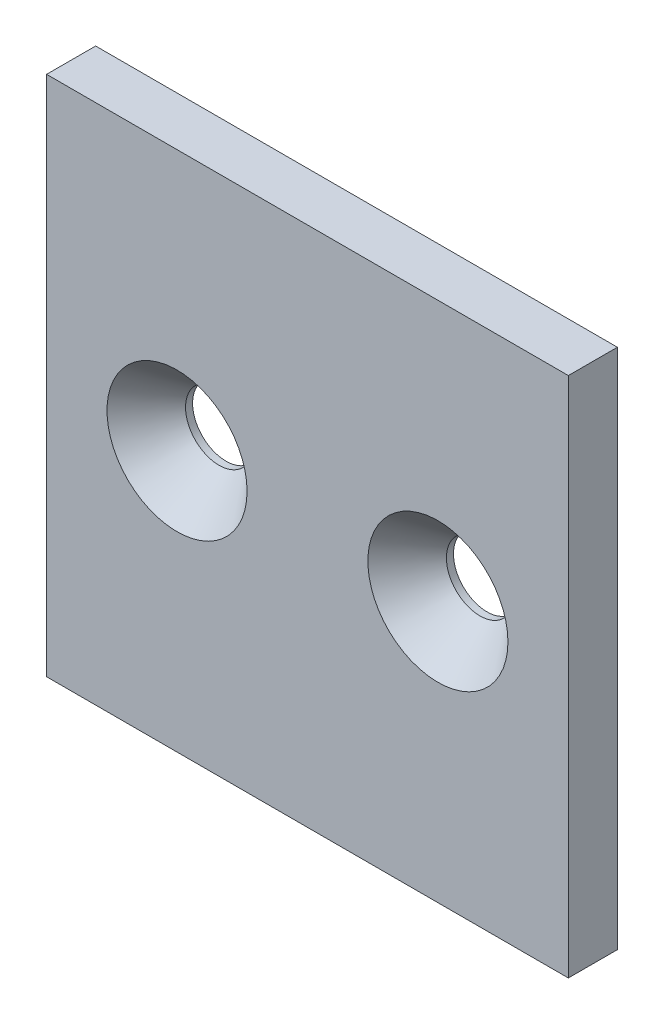
ISO-10303-21;
HEADER;
FILE_DESCRIPTION(('STEP AP214'),'2;1');
FILE_NAME('part.step','',(''),(''),'','','');
FILE_SCHEMA(('AUTOMOTIVE_DESIGN { 1 0 10303 214 1 1 1 1 }'));
ENDSEC;
DATA;
#1=APPLICATION_CONTEXT('core data for automotive mechanical design processes');
#2=APPLICATION_PROTOCOL_DEFINITION('international standard','automotive_design',2000,#1);
#3=PRODUCT_CONTEXT('',#1,'mechanical');
#4=PRODUCT('Part','Part','',(#3));
#5=PRODUCT_RELATED_PRODUCT_CATEGORY('part','',(#4));
#6=PRODUCT_DEFINITION_FORMATION('','',#4);
#7=PRODUCT_DEFINITION_CONTEXT('part definition',#1,'design');
#8=PRODUCT_DEFINITION('design','',#6,#7);
#9=PRODUCT_DEFINITION_SHAPE('','',#8);
#10=(LENGTH_UNIT() NAMED_UNIT(*) SI_UNIT(.MILLI.,.METRE.));
#11=(NAMED_UNIT(*) PLANE_ANGLE_UNIT() SI_UNIT($,.RADIAN.));
#12=(NAMED_UNIT(*) SI_UNIT($,.STERADIAN.) SOLID_ANGLE_UNIT());
#13=UNCERTAINTY_MEASURE_WITH_UNIT(LENGTH_MEASURE(1.E-05),#10,'distance_accuracy_value','');
#14=(GEOMETRIC_REPRESENTATION_CONTEXT(3) GLOBAL_UNCERTAINTY_ASSIGNED_CONTEXT((#13)) GLOBAL_UNIT_ASSIGNED_CONTEXT((#10,
#11,#12)) REPRESENTATION_CONTEXT('',''));
#15=CARTESIAN_POINT('',(0.,0.,0.));
#16=DIRECTION('',(0.,0.,1.));
#17=DIRECTION('',(1.,0.,0.));
#18=AXIS2_PLACEMENT_3D('',#15,#16,#17);
#19=CARTESIAN_POINT('',(0.,0.,2.3876));
#20=DIRECTION('',(0.,0.,-1.));
#21=DIRECTION('',(-1.,0.,0.));
#22=AXIS2_PLACEMENT_3D('',#19,#20,#21);
#23=PLANE('',#22);
#24=CARTESIAN_POINT('',(12.7,25.4,2.3876));
#25=DIRECTION('',(0.,0.,1.));
#26=DIRECTION('',(1.,0.,0.));
#27=AXIS2_PLACEMENT_3D('',#24,#25,#26);
#28=CIRCLE('',#27,6.81876118562569);
#29=CARTESIAN_POINT('',(19.5187611856257,25.4,2.3876));
#30=VERTEX_POINT('',#29);
#31=EDGE_CURVE('E132',#30,#30,#28,.T.);
#32=ORIENTED_EDGE('',*,*,#31,.F.);
#33=EDGE_LOOP('',(#32));
#34=FACE_BOUND('',#33,.T.);
#35=DIRECTION('',(1.,0.,0.));
#36=VECTOR('',#35,1.);
#37=CARTESIAN_POINT('',(50.8,0.,2.3876));
#38=LINE('',#37,#36);
#39=CARTESIAN_POINT('',(0.,0.,2.3876));
#40=VERTEX_POINT('',#39);
#41=CARTESIAN_POINT('',(50.8,0.,2.3876));
#42=VERTEX_POINT('',#41);
#43=EDGE_CURVE('E100',#40,#42,#38,.T.);
#44=ORIENTED_EDGE('',*,*,#43,.T.);
#45=DIRECTION('',(0.,1.,0.));
#46=VECTOR('',#45,1.);
#47=CARTESIAN_POINT('',(50.8,50.8,2.3876));
#48=LINE('',#47,#46);
#49=CARTESIAN_POINT('',(50.8,50.8,2.3876));
#50=VERTEX_POINT('',#49);
#51=EDGE_CURVE('E95',#42,#50,#48,.T.);
#52=ORIENTED_EDGE('',*,*,#51,.T.);
#53=DIRECTION('',(-1.,0.,0.));
#54=VECTOR('',#53,1.);
#55=CARTESIAN_POINT('',(50.8,50.8,2.3876));
#56=LINE('',#55,#54);
#57=CARTESIAN_POINT('',(0.,50.8,2.3876));
#58=VERTEX_POINT('',#57);
#59=EDGE_CURVE('E98',#50,#58,#56,.T.);
#60=ORIENTED_EDGE('',*,*,#59,.T.);
#61=DIRECTION('',(0.,-1.,0.));
#62=VECTOR('',#61,1.);
#63=CARTESIAN_POINT('',(0.,0.,2.3876));
#64=LINE('',#63,#62);
#65=EDGE_CURVE('E65',#58,#40,#64,.T.);
#66=ORIENTED_EDGE('',*,*,#65,.T.);
#67=EDGE_LOOP('',(#44,#52,#60,#66));
#68=FACE_BOUND('',#67,.T.);
#69=CARTESIAN_POINT('',(38.1,25.4,2.3876));
#70=DIRECTION('',(0.,0.,1.));
#71=DIRECTION('',(1.,0.,0.));
#72=AXIS2_PLACEMENT_3D('',#69,#70,#71);
#73=CIRCLE('',#72,6.81876118562569);
#74=CARTESIAN_POINT('',(44.9187611856257,25.4,2.3876));
#75=VERTEX_POINT('',#74);
#76=EDGE_CURVE('E138',#75,#75,#73,.T.);
#77=ORIENTED_EDGE('',*,*,#76,.F.);
#78=EDGE_LOOP('',(#77));
#79=FACE_BOUND('',#78,.T.);
#80=ADVANCED_FACE('F48',(#34,#68,#79),#23,.F.);
#81=CARTESIAN_POINT('',(38.1,25.4,2.3876));
#82=DIRECTION('',(0.,0.,-1.));
#83=DIRECTION('',(-1.,0.,0.));
#84=AXIS2_PLACEMENT_3D('',#81,#82,#83);
#85=CYLINDRICAL_SURFACE('',#84,3.2639);
#86=CARTESIAN_POINT('',(38.1,25.4,-2.3876));
#87=DIRECTION('',(0.,0.,1.));
#88=DIRECTION('',(1.,0.,0.));
#89=AXIS2_PLACEMENT_3D('',#86,#87,#88);
#90=CIRCLE('',#89,3.2639);
#91=CARTESIAN_POINT('',(41.3639,25.4,-2.3876));
#92=VERTEX_POINT('',#91);
#93=EDGE_CURVE('E129',#92,#92,#90,.T.);
#94=ORIENTED_EDGE('',*,*,#93,.F.);
#95=EDGE_LOOP('',(#94));
#96=FACE_BOUND('',#95,.T.);
#97=CARTESIAN_POINT('',(38.1,25.4,-1.7018));
#98=DIRECTION('',(0.,0.,1.));
#99=DIRECTION('',(1.,0.,0.));
#100=AXIS2_PLACEMENT_3D('',#97,#98,#99);
#101=CIRCLE('',#100,3.2639);
#102=CARTESIAN_POINT('',(41.3639,25.4,-1.7018));
#103=VERTEX_POINT('',#102);
#104=EDGE_CURVE('E141',#103,#103,#101,.T.);
#105=ORIENTED_EDGE('',*,*,#104,.T.);
#106=EDGE_LOOP('',(#105));
#107=FACE_BOUND('',#106,.T.);
#108=ADVANCED_FACE('F145',(#96,#107),#85,.F.);
#109=CARTESIAN_POINT('',(12.7,25.4,2.3876));
#110=DIRECTION('',(0.,0.,-1.));
#111=DIRECTION('',(-1.,0.,0.));
#112=AXIS2_PLACEMENT_3D('',#109,#110,#111);
#113=CYLINDRICAL_SURFACE('',#112,3.2639);
#114=CARTESIAN_POINT('',(12.7,25.4,-2.3876));
#115=DIRECTION('',(0.,0.,1.));
#116=DIRECTION('',(1.,0.,0.));
#117=AXIS2_PLACEMENT_3D('',#114,#115,#116);
#118=CIRCLE('',#117,3.2639);
#119=CARTESIAN_POINT('',(15.9639,25.4,-2.3876));
#120=VERTEX_POINT('',#119);
#121=EDGE_CURVE('E115',#120,#120,#118,.T.);
#122=ORIENTED_EDGE('',*,*,#121,.F.);
#123=EDGE_LOOP('',(#122));
#124=FACE_BOUND('',#123,.T.);
#125=CARTESIAN_POINT('',(12.7,25.4,-1.7018));
#126=DIRECTION('',(0.,0.,1.));
#127=DIRECTION('',(1.,0.,0.));
#128=AXIS2_PLACEMENT_3D('',#125,#126,#127);
#129=CIRCLE('',#128,3.2639);
#130=CARTESIAN_POINT('',(15.9639,25.4,-1.7018));
#131=VERTEX_POINT('',#130);
#132=EDGE_CURVE('E135',#131,#131,#129,.T.);
#133=ORIENTED_EDGE('',*,*,#132,.T.);
#134=EDGE_LOOP('',(#133));
#135=FACE_BOUND('',#134,.T.);
#136=ADVANCED_FACE('F163',(#124,#135),#113,.F.);
#137=CARTESIAN_POINT('',(0.,0.,-2.3876));
#138=DIRECTION('',(0.,0.,-1.));
#139=DIRECTION('',(-1.,0.,0.));
#140=AXIS2_PLACEMENT_3D('',#137,#138,#139);
#141=PLANE('',#140);
#142=ORIENTED_EDGE('',*,*,#121,.T.);
#143=EDGE_LOOP('',(#142));
#144=FACE_BOUND('',#143,.T.);
#145=DIRECTION('',(1.,0.,0.));
#146=VECTOR('',#145,1.);
#147=CARTESIAN_POINT('',(50.8,0.,-2.3876));
#148=LINE('',#147,#146);
#149=CARTESIAN_POINT('',(0.,0.,-2.3876));
#150=VERTEX_POINT('',#149);
#151=CARTESIAN_POINT('',(50.8,0.,-2.3876));
#152=VERTEX_POINT('',#151);
#153=EDGE_CURVE('E112',#150,#152,#148,.T.);
#154=ORIENTED_EDGE('',*,*,#153,.F.);
#155=DIRECTION('',(0.,-1.,0.));
#156=VECTOR('',#155,1.);
#157=CARTESIAN_POINT('',(0.,0.,-2.3876));
#158=LINE('',#157,#156);
#159=CARTESIAN_POINT('',(0.,50.8,-2.3876));
#160=VERTEX_POINT('',#159);
#161=EDGE_CURVE('E88',#160,#150,#158,.T.);
#162=ORIENTED_EDGE('',*,*,#161,.F.);
#163=DIRECTION('',(-1.,0.,0.));
#164=VECTOR('',#163,1.);
#165=CARTESIAN_POINT('',(50.8,50.8,-2.3876));
#166=LINE('',#165,#164);
#167=CARTESIAN_POINT('',(50.8,50.8,-2.3876));
#168=VERTEX_POINT('',#167);
#169=EDGE_CURVE('E82',#168,#160,#166,.T.);
#170=ORIENTED_EDGE('',*,*,#169,.F.);
#171=DIRECTION('',(0.,1.,0.));
#172=VECTOR('',#171,1.);
#173=CARTESIAN_POINT('',(50.8,50.8,-2.3876));
#174=LINE('',#173,#172);
#175=EDGE_CURVE('E104',#152,#168,#174,.T.);
#176=ORIENTED_EDGE('',*,*,#175,.F.);
#177=EDGE_LOOP('',(#154,#162,#170,#176));
#178=FACE_BOUND('',#177,.T.);
#179=ORIENTED_EDGE('',*,*,#93,.T.);
#180=EDGE_LOOP('',(#179));
#181=FACE_BOUND('',#180,.T.);
#182=ADVANCED_FACE('F123',(#144,#178,#181),#141,.T.);
#183=CARTESIAN_POINT('',(50.8,0.,2.3876));
#184=DIRECTION('',(0.,1.,0.));
#185=DIRECTION('',(-1.,0.,0.));
#186=AXIS2_PLACEMENT_3D('',#183,#184,#185);
#187=PLANE('',#186);
#188=ORIENTED_EDGE('',*,*,#153,.T.);
#189=DIRECTION('',(0.,0.,-1.));
#190=VECTOR('',#189,1.);
#191=CARTESIAN_POINT('',(50.8,0.,2.3876));
#192=LINE('',#191,#190);
#193=EDGE_CURVE('E12',#42,#152,#192,.T.);
#194=ORIENTED_EDGE('',*,*,#193,.F.);
#195=ORIENTED_EDGE('',*,*,#43,.F.);
#196=DIRECTION('',(0.,0.,-1.));
#197=VECTOR('',#196,1.);
#198=CARTESIAN_POINT('',(0.,0.,2.3876));
#199=LINE('',#198,#197);
#200=EDGE_CURVE('E108',#40,#150,#199,.T.);
#201=ORIENTED_EDGE('',*,*,#200,.T.);
#202=EDGE_LOOP('',(#188,#194,#195,#201));
#203=FACE_BOUND('',#202,.T.);
#204=ADVANCED_FACE('F50',(#203),#187,.F.);
#205=CARTESIAN_POINT('',(50.8,50.8,2.3876));
#206=DIRECTION('',(-1.,0.,0.));
#207=DIRECTION('',(0.,0.,1.));
#208=AXIS2_PLACEMENT_3D('',#205,#206,#207);
#209=PLANE('',#208);
#210=ORIENTED_EDGE('',*,*,#175,.T.);
#211=DIRECTION('',(0.,0.,-1.));
#212=VECTOR('',#211,1.);
#213=CARTESIAN_POINT('',(50.8,50.8,2.3876));
#214=LINE('',#213,#212);
#215=EDGE_CURVE('E57',#50,#168,#214,.T.);
#216=ORIENTED_EDGE('',*,*,#215,.F.);
#217=ORIENTED_EDGE('',*,*,#51,.F.);
#218=ORIENTED_EDGE('',*,*,#193,.T.);
#219=EDGE_LOOP('',(#210,#216,#217,#218));
#220=FACE_BOUND('',#219,.T.);
#221=ADVANCED_FACE('F103',(#220),#209,.F.);
#222=CARTESIAN_POINT('',(50.8,50.8,2.3876));
#223=DIRECTION('',(0.,-1.,0.));
#224=DIRECTION('',(1.,0.,0.));
#225=AXIS2_PLACEMENT_3D('',#222,#223,#224);
#226=PLANE('',#225);
#227=ORIENTED_EDGE('',*,*,#169,.T.);
#228=DIRECTION('',(0.,0.,-1.));
#229=VECTOR('',#228,1.);
#230=CARTESIAN_POINT('',(0.,50.8,2.3876));
#231=LINE('',#230,#229);
#232=EDGE_CURVE('E105',#58,#160,#231,.T.);
#233=ORIENTED_EDGE('',*,*,#232,.F.);
#234=ORIENTED_EDGE('',*,*,#59,.F.);
#235=ORIENTED_EDGE('',*,*,#215,.T.);
#236=EDGE_LOOP('',(#227,#233,#234,#235));
#237=FACE_BOUND('',#236,.T.);
#238=ADVANCED_FACE('F106',(#237),#226,.F.);
#239=CARTESIAN_POINT('',(0.,0.,2.3876));
#240=DIRECTION('',(1.,0.,0.));
#241=DIRECTION('',(0.,0.,-1.));
#242=AXIS2_PLACEMENT_3D('',#239,#240,#241);
#243=PLANE('',#242);
#244=ORIENTED_EDGE('',*,*,#161,.T.);
#245=ORIENTED_EDGE('',*,*,#200,.F.);
#246=ORIENTED_EDGE('',*,*,#65,.F.);
#247=ORIENTED_EDGE('',*,*,#232,.T.);
#248=EDGE_LOOP('',(#244,#245,#246,#247));
#249=FACE_BOUND('',#248,.T.);
#250=ADVANCED_FACE('F120',(#249),#243,.F.);
#251=CARTESIAN_POINT('',(12.7,25.4,-1.7018));
#252=DIRECTION('',(0.,0.,1.));
#253=DIRECTION('',(1.,0.,0.));
#254=AXIS2_PLACEMENT_3D('',#251,#252,#253);
#255=CONICAL_SURFACE('',#254,3.2639,0.715584993317677);
#256=ORIENTED_EDGE('',*,*,#31,.T.);
#257=EDGE_LOOP('',(#256));
#258=FACE_BOUND('',#257,.T.);
#259=ORIENTED_EDGE('',*,*,#132,.F.);
#260=EDGE_LOOP('',(#259));
#261=FACE_BOUND('',#260,.T.);
#262=ADVANCED_FACE('F149',(#258,#261),#255,.F.);
#263=CARTESIAN_POINT('',(38.1,25.4,-1.7018));
#264=DIRECTION('',(0.,0.,1.));
#265=DIRECTION('',(1.,0.,0.));
#266=AXIS2_PLACEMENT_3D('',#263,#264,#265);
#267=CONICAL_SURFACE('',#266,3.2639,0.715584993317677);
#268=ORIENTED_EDGE('',*,*,#76,.T.);
#269=EDGE_LOOP('',(#268));
#270=FACE_BOUND('',#269,.T.);
#271=ORIENTED_EDGE('',*,*,#104,.F.);
#272=EDGE_LOOP('',(#271));
#273=FACE_BOUND('',#272,.T.);
#274=ADVANCED_FACE('F147',(#270,#273),#267,.F.);
#275=CLOSED_SHELL('',(#80,#108,#136,#182,#204,#221,#238,#250,#262,#274));
#276=MANIFOLD_SOLID_BREP('B2',#275);
#277=ADVANCED_BREP_SHAPE_REPRESENTATION('',(#18,#276),#14);
#278=SHAPE_DEFINITION_REPRESENTATION(#9,#277);
ENDSEC;
END-ISO-10303-21;
